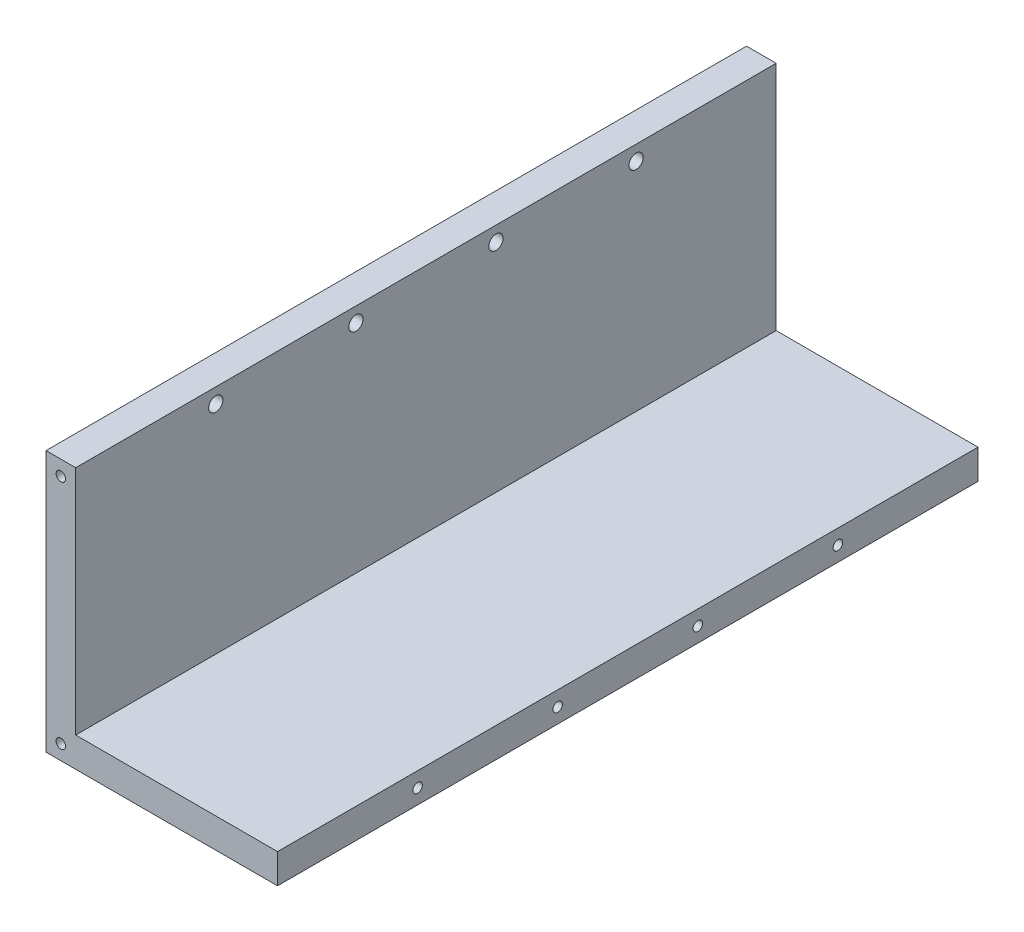
ISO-10303-21;
HEADER;
FILE_DESCRIPTION(('STEP AP214'),'2;1');
FILE_NAME('part.step','',(''),(''),'','','');
FILE_SCHEMA(('AUTOMOTIVE_DESIGN { 1 0 10303 214 1 1 1 1 }'));
ENDSEC;
DATA;
#1=APPLICATION_CONTEXT('core data for automotive mechanical design processes');
#2=APPLICATION_PROTOCOL_DEFINITION('international standard','automotive_design',2000,#1);
#3=PRODUCT_CONTEXT('',#1,'mechanical');
#4=PRODUCT('Part','Part','',(#3));
#5=PRODUCT_RELATED_PRODUCT_CATEGORY('part','',(#4));
#6=PRODUCT_DEFINITION_FORMATION('','',#4);
#7=PRODUCT_DEFINITION_CONTEXT('part definition',#1,'design');
#8=PRODUCT_DEFINITION('design','',#6,#7);
#9=PRODUCT_DEFINITION_SHAPE('','',#8);
#10=(LENGTH_UNIT() NAMED_UNIT(*) SI_UNIT(.MILLI.,.METRE.));
#11=(NAMED_UNIT(*) PLANE_ANGLE_UNIT() SI_UNIT($,.RADIAN.));
#12=(NAMED_UNIT(*) SI_UNIT($,.STERADIAN.) SOLID_ANGLE_UNIT());
#13=UNCERTAINTY_MEASURE_WITH_UNIT(LENGTH_MEASURE(1.E-05),#10,'distance_accuracy_value','');
#14=(GEOMETRIC_REPRESENTATION_CONTEXT(3) GLOBAL_UNCERTAINTY_ASSIGNED_CONTEXT((#13)) GLOBAL_UNIT_ASSIGNED_CONTEXT((#10,
#11,#12)) REPRESENTATION_CONTEXT('',''));
#15=CARTESIAN_POINT('',(0.,0.,0.));
#16=DIRECTION('',(0.,0.,1.));
#17=DIRECTION('',(1.,0.,0.));
#18=AXIS2_PLACEMENT_3D('',#15,#16,#17);
#19=CARTESIAN_POINT('',(0.,0.,118.));
#20=DIRECTION('',(-1.,0.,0.));
#21=DIRECTION('',(0.,0.,1.));
#22=AXIS2_PLACEMENT_3D('',#19,#20,#21);
#23=PLANE('',#22);
#24=CARTESIAN_POINT('',(0.,36.5,70.8));
#25=DIRECTION('',(-1.,0.,0.));
#26=DIRECTION('',(0.,0.,1.));
#27=AXIS2_PLACEMENT_3D('',#24,#25,#26);
#28=CIRCLE('',#27,1.2);
#29=CARTESIAN_POINT('',(0.,36.5,72.));
#30=VERTEX_POINT('',#29);
#31=EDGE_CURVE('E222',#30,#30,#28,.F.);
#32=ORIENTED_EDGE('',*,*,#31,.F.);
#33=EDGE_LOOP('',(#32));
#34=FACE_BOUND('',#33,.T.);
#35=DIRECTION('',(0.,1.,0.));
#36=VECTOR('',#35,1.);
#37=CARTESIAN_POINT('',(0.,0.,0.));
#38=LINE('',#37,#36);
#39=CARTESIAN_POINT('',(0.,0.,0.));
#40=VERTEX_POINT('',#39);
#41=CARTESIAN_POINT('',(0.,39.,0.));
#42=VERTEX_POINT('',#41);
#43=EDGE_CURVE('E136',#40,#42,#38,.T.);
#44=ORIENTED_EDGE('',*,*,#43,.T.);
#45=DIRECTION('',(0.,0.,-1.));
#46=VECTOR('',#45,1.);
#47=CARTESIAN_POINT('',(0.,39.,118.));
#48=LINE('',#47,#46);
#49=CARTESIAN_POINT('',(0.,39.,118.));
#50=VERTEX_POINT('',#49);
#51=EDGE_CURVE('E54',#50,#42,#48,.T.);
#52=ORIENTED_EDGE('',*,*,#51,.F.);
#53=DIRECTION('',(0.,1.,0.));
#54=VECTOR('',#53,1.);
#55=CARTESIAN_POINT('',(0.,0.,118.));
#56=LINE('',#55,#54);
#57=CARTESIAN_POINT('',(0.,0.,118.));
#58=VERTEX_POINT('',#57);
#59=EDGE_CURVE('E99',#58,#50,#56,.T.);
#60=ORIENTED_EDGE('',*,*,#59,.F.);
#61=DIRECTION('',(0.,0.,-1.));
#62=VECTOR('',#61,1.);
#63=CARTESIAN_POINT('',(0.,0.,118.));
#64=LINE('',#63,#62);
#65=EDGE_CURVE('E11',#58,#40,#64,.T.);
#66=ORIENTED_EDGE('',*,*,#65,.T.);
#67=EDGE_LOOP('',(#44,#52,#60,#66));
#68=FACE_BOUND('',#67,.T.);
#69=CARTESIAN_POINT('',(0.,36.5,23.6));
#70=DIRECTION('',(-1.,0.,0.));
#71=DIRECTION('',(0.,0.,1.));
#72=AXIS2_PLACEMENT_3D('',#69,#70,#71);
#73=CIRCLE('',#72,1.2);
#74=CARTESIAN_POINT('',(0.,36.5,24.8));
#75=VERTEX_POINT('',#74);
#76=EDGE_CURVE('E137',#75,#75,#73,.F.);
#77=ORIENTED_EDGE('',*,*,#76,.F.);
#78=EDGE_LOOP('',(#77));
#79=FACE_BOUND('',#78,.T.);
#80=CARTESIAN_POINT('',(0.,36.5,47.2));
#81=DIRECTION('',(-1.,0.,0.));
#82=DIRECTION('',(0.,0.,1.));
#83=AXIS2_PLACEMENT_3D('',#80,#81,#82);
#84=CIRCLE('',#83,1.2);
#85=CARTESIAN_POINT('',(0.,36.5,48.4));
#86=VERTEX_POINT('',#85);
#87=EDGE_CURVE('E202',#86,#86,#84,.F.);
#88=ORIENTED_EDGE('',*,*,#87,.F.);
#89=EDGE_LOOP('',(#88));
#90=FACE_BOUND('',#89,.T.);
#91=CARTESIAN_POINT('',(0.,36.5,94.4));
#92=DIRECTION('',(-1.,0.,0.));
#93=DIRECTION('',(0.,0.,1.));
#94=AXIS2_PLACEMENT_3D('',#91,#92,#93);
#95=CIRCLE('',#94,1.2);
#96=CARTESIAN_POINT('',(0.,36.5,95.6));
#97=VERTEX_POINT('',#96);
#98=EDGE_CURVE('E216',#97,#97,#95,.F.);
#99=ORIENTED_EDGE('',*,*,#98,.F.);
#100=EDGE_LOOP('',(#99));
#101=FACE_BOUND('',#100,.T.);
#102=ADVANCED_FACE('F45',(#34,#68,#79,#90,#101),#23,.F.);
#103=CARTESIAN_POINT('',(0.,0.,118.));
#104=DIRECTION('',(0.,-1.,0.));
#105=DIRECTION('',(1.,0.,0.));
#106=AXIS2_PLACEMENT_3D('',#103,#104,#105);
#107=PLANE('',#106);
#108=DIRECTION('',(-1.,0.,0.));
#109=VECTOR('',#108,1.);
#110=CARTESIAN_POINT('',(0.,0.,0.));
#111=LINE('',#110,#109);
#112=CARTESIAN_POINT('',(34.,0.,0.));
#113=VERTEX_POINT('',#112);
#114=EDGE_CURVE('E133',#113,#40,#111,.T.);
#115=ORIENTED_EDGE('',*,*,#114,.T.);
#116=ORIENTED_EDGE('',*,*,#65,.F.);
#117=DIRECTION('',(-1.,0.,0.));
#118=VECTOR('',#117,1.);
#119=CARTESIAN_POINT('',(0.,0.,118.));
#120=LINE('',#119,#118);
#121=CARTESIAN_POINT('',(34.,0.,118.));
#122=VERTEX_POINT('',#121);
#123=EDGE_CURVE('E144',#122,#58,#120,.T.);
#124=ORIENTED_EDGE('',*,*,#123,.F.);
#125=DIRECTION('',(0.,0.,-1.));
#126=VECTOR('',#125,1.);
#127=CARTESIAN_POINT('',(34.,0.,118.));
#128=LINE('',#127,#126);
#129=EDGE_CURVE('E129',#122,#113,#128,.T.);
#130=ORIENTED_EDGE('',*,*,#129,.T.);
#131=EDGE_LOOP('',(#115,#116,#124,#130));
#132=FACE_BOUND('',#131,.T.);
#133=ADVANCED_FACE('F47',(#132),#107,.F.);
#134=CARTESIAN_POINT('',(0.,39.,118.));
#135=DIRECTION('',(0.,-1.,0.));
#136=DIRECTION('',(0.,0.,-1.));
#137=AXIS2_PLACEMENT_3D('',#134,#135,#136);
#138=PLANE('',#137);
#139=DIRECTION('',(-1.,0.,0.));
#140=VECTOR('',#139,1.);
#141=CARTESIAN_POINT('',(0.,39.,0.));
#142=LINE('',#141,#140);
#143=CARTESIAN_POINT('',(-5.,39.,0.));
#144=VERTEX_POINT('',#143);
#145=EDGE_CURVE('E139',#42,#144,#142,.T.);
#146=ORIENTED_EDGE('',*,*,#145,.T.);
#147=DIRECTION('',(0.,0.,-1.));
#148=VECTOR('',#147,1.);
#149=CARTESIAN_POINT('',(-5.,39.,118.));
#150=LINE('',#149,#148);
#151=CARTESIAN_POINT('',(-5.,39.,118.));
#152=VERTEX_POINT('',#151);
#153=EDGE_CURVE('E124',#152,#144,#150,.T.);
#154=ORIENTED_EDGE('',*,*,#153,.F.);
#155=DIRECTION('',(-1.,0.,0.));
#156=VECTOR('',#155,1.);
#157=CARTESIAN_POINT('',(0.,39.,118.));
#158=LINE('',#157,#156);
#159=EDGE_CURVE('E114',#50,#152,#158,.T.);
#160=ORIENTED_EDGE('',*,*,#159,.F.);
#161=ORIENTED_EDGE('',*,*,#51,.T.);
#162=EDGE_LOOP('',(#146,#154,#160,#161));
#163=FACE_BOUND('',#162,.T.);
#164=ADVANCED_FACE('F150',(#163),#138,.F.);
#165=CARTESIAN_POINT('',(-5.,-5.,118.));
#166=DIRECTION('',(1.,0.,0.));
#167=DIRECTION('',(0.,1.,0.));
#168=AXIS2_PLACEMENT_3D('',#165,#166,#167);
#169=PLANE('',#168);
#170=CARTESIAN_POINT('',(-5.,36.5,70.8));
#171=DIRECTION('',(-1.,0.,0.));
#172=DIRECTION('',(0.,0.,1.));
#173=AXIS2_PLACEMENT_3D('',#170,#171,#172);
#174=CIRCLE('',#173,2.2);
#175=CARTESIAN_POINT('',(-5.,36.5,73.));
#176=VERTEX_POINT('',#175);
#177=EDGE_CURVE('E188',#176,#176,#174,.T.);
#178=ORIENTED_EDGE('',*,*,#177,.F.);
#179=EDGE_LOOP('',(#178));
#180=FACE_BOUND('',#179,.T.);
#181=CARTESIAN_POINT('',(-5.,36.5,94.4));
#182=DIRECTION('',(-1.,0.,0.));
#183=DIRECTION('',(0.,0.,1.));
#184=AXIS2_PLACEMENT_3D('',#181,#182,#183);
#185=CIRCLE('',#184,2.2);
#186=CARTESIAN_POINT('',(-5.,36.5,96.6));
#187=VERTEX_POINT('',#186);
#188=EDGE_CURVE('E192',#187,#187,#185,.T.);
#189=ORIENTED_EDGE('',*,*,#188,.F.);
#190=EDGE_LOOP('',(#189));
#191=FACE_BOUND('',#190,.T.);
#192=CARTESIAN_POINT('',(-5.,36.5,47.2));
#193=DIRECTION('',(-1.,0.,0.));
#194=DIRECTION('',(0.,0.,1.));
#195=AXIS2_PLACEMENT_3D('',#192,#193,#194);
#196=CIRCLE('',#195,2.2);
#197=CARTESIAN_POINT('',(-5.,36.5,49.4));
#198=VERTEX_POINT('',#197);
#199=EDGE_CURVE('E196',#198,#198,#196,.T.);
#200=ORIENTED_EDGE('',*,*,#199,.F.);
#201=EDGE_LOOP('',(#200));
#202=FACE_BOUND('',#201,.T.);
#203=CARTESIAN_POINT('',(-5.,36.5,23.6));
#204=DIRECTION('',(-1.,0.,0.));
#205=DIRECTION('',(0.,0.,1.));
#206=AXIS2_PLACEMENT_3D('',#203,#204,#205);
#207=CIRCLE('',#206,2.2);
#208=CARTESIAN_POINT('',(-5.,36.5,25.8));
#209=VERTEX_POINT('',#208);
#210=EDGE_CURVE('E199',#209,#209,#207,.T.);
#211=ORIENTED_EDGE('',*,*,#210,.F.);
#212=EDGE_LOOP('',(#211));
#213=FACE_BOUND('',#212,.T.);
#214=DIRECTION('',(0.,-1.,0.));
#215=VECTOR('',#214,1.);
#216=CARTESIAN_POINT('',(-5.,-5.,0.));
#217=LINE('',#216,#215);
#218=CARTESIAN_POINT('',(-5.,-5.,0.));
#219=VERTEX_POINT('',#218);
#220=EDGE_CURVE('E123',#144,#219,#217,.T.);
#221=ORIENTED_EDGE('',*,*,#220,.T.);
#222=DIRECTION('',(0.,0.,-1.));
#223=VECTOR('',#222,1.);
#224=CARTESIAN_POINT('',(-5.,-5.,118.));
#225=LINE('',#224,#223);
#226=CARTESIAN_POINT('',(-5.,-5.,118.));
#227=VERTEX_POINT('',#226);
#228=EDGE_CURVE('E120',#227,#219,#225,.T.);
#229=ORIENTED_EDGE('',*,*,#228,.F.);
#230=DIRECTION('',(0.,-1.,0.));
#231=VECTOR('',#230,1.);
#232=CARTESIAN_POINT('',(-5.,-5.,118.));
#233=LINE('',#232,#231);
#234=EDGE_CURVE('E108',#152,#227,#233,.T.);
#235=ORIENTED_EDGE('',*,*,#234,.F.);
#236=ORIENTED_EDGE('',*,*,#153,.T.);
#237=EDGE_LOOP('',(#221,#229,#235,#236));
#238=FACE_BOUND('',#237,.T.);
#239=ADVANCED_FACE('F121',(#180,#191,#202,#213,#238),#169,.F.);
#240=CARTESIAN_POINT('',(0.,-5.,118.));
#241=DIRECTION('',(0.,1.,0.));
#242=DIRECTION('',(-1.,0.,0.));
#243=AXIS2_PLACEMENT_3D('',#240,#241,#242);
#244=PLANE('',#243);
#245=DIRECTION('',(1.,0.,0.));
#246=VECTOR('',#245,1.);
#247=CARTESIAN_POINT('',(0.,-5.,0.));
#248=LINE('',#247,#246);
#249=CARTESIAN_POINT('',(34.,-5.,0.));
#250=VERTEX_POINT('',#249);
#251=EDGE_CURVE('E85',#219,#250,#248,.T.);
#252=ORIENTED_EDGE('',*,*,#251,.T.);
#253=DIRECTION('',(0.,0.,-1.));
#254=VECTOR('',#253,1.);
#255=CARTESIAN_POINT('',(34.,-5.,118.));
#256=LINE('',#255,#254);
#257=CARTESIAN_POINT('',(34.,-5.,118.));
#258=VERTEX_POINT('',#257);
#259=EDGE_CURVE('E125',#258,#250,#256,.T.);
#260=ORIENTED_EDGE('',*,*,#259,.F.);
#261=DIRECTION('',(1.,0.,0.));
#262=VECTOR('',#261,1.);
#263=CARTESIAN_POINT('',(0.,-5.,118.));
#264=LINE('',#263,#262);
#265=EDGE_CURVE('E112',#227,#258,#264,.T.);
#266=ORIENTED_EDGE('',*,*,#265,.F.);
#267=ORIENTED_EDGE('',*,*,#228,.T.);
#268=EDGE_LOOP('',(#252,#260,#266,#267));
#269=FACE_BOUND('',#268,.T.);
#270=ADVANCED_FACE('F127',(#269),#244,.F.);
#271=CARTESIAN_POINT('',(34.,0.,118.));
#272=DIRECTION('',(-1.,0.,0.));
#273=DIRECTION('',(0.,0.,1.));
#274=AXIS2_PLACEMENT_3D('',#271,#272,#273);
#275=PLANE('',#274);
#276=CARTESIAN_POINT('',(34.,-2.5,70.8));
#277=DIRECTION('',(1.,0.,0.));
#278=DIRECTION('',(0.,0.,-1.));
#279=AXIS2_PLACEMENT_3D('',#276,#277,#278);
#280=CIRCLE('',#279,0.799999999999999);
#281=CARTESIAN_POINT('',(34.,-2.5,70.));
#282=VERTEX_POINT('',#281);
#283=EDGE_CURVE('E252',#282,#282,#280,.T.);
#284=ORIENTED_EDGE('',*,*,#283,.F.);
#285=EDGE_LOOP('',(#284));
#286=FACE_BOUND('',#285,.T.);
#287=CARTESIAN_POINT('',(34.,-2.5,94.4));
#288=DIRECTION('',(1.,0.,0.));
#289=DIRECTION('',(0.,0.,-1.));
#290=AXIS2_PLACEMENT_3D('',#287,#288,#289);
#291=CIRCLE('',#290,0.799999999999999);
#292=CARTESIAN_POINT('',(34.,-2.5,93.6));
#293=VERTEX_POINT('',#292);
#294=EDGE_CURVE('E246',#293,#293,#291,.T.);
#295=ORIENTED_EDGE('',*,*,#294,.F.);
#296=EDGE_LOOP('',(#295));
#297=FACE_BOUND('',#296,.T.);
#298=CARTESIAN_POINT('',(34.,-2.5,47.2));
#299=DIRECTION('',(1.,0.,0.));
#300=DIRECTION('',(0.,0.,-1.));
#301=AXIS2_PLACEMENT_3D('',#298,#299,#300);
#302=CIRCLE('',#301,0.799999999999999);
#303=CARTESIAN_POINT('',(34.,-2.5,46.4));
#304=VERTEX_POINT('',#303);
#305=EDGE_CURVE('E240',#304,#304,#302,.T.);
#306=ORIENTED_EDGE('',*,*,#305,.F.);
#307=EDGE_LOOP('',(#306));
#308=FACE_BOUND('',#307,.T.);
#309=CARTESIAN_POINT('',(34.,-2.5,23.6));
#310=DIRECTION('',(1.,0.,0.));
#311=DIRECTION('',(0.,0.,-1.));
#312=AXIS2_PLACEMENT_3D('',#309,#310,#311);
#313=CIRCLE('',#312,0.799999999999999);
#314=CARTESIAN_POINT('',(34.,-2.5,22.8));
#315=VERTEX_POINT('',#314);
#316=EDGE_CURVE('E234',#315,#315,#313,.T.);
#317=ORIENTED_EDGE('',*,*,#316,.F.);
#318=EDGE_LOOP('',(#317));
#319=FACE_BOUND('',#318,.T.);
#320=DIRECTION('',(0.,1.,0.));
#321=VECTOR('',#320,1.);
#322=CARTESIAN_POINT('',(34.,0.,0.));
#323=LINE('',#322,#321);
#324=EDGE_CURVE('E91',#250,#113,#323,.T.);
#325=ORIENTED_EDGE('',*,*,#324,.T.);
#326=ORIENTED_EDGE('',*,*,#129,.F.);
#327=DIRECTION('',(0.,1.,0.));
#328=VECTOR('',#327,1.);
#329=CARTESIAN_POINT('',(34.,0.,118.));
#330=LINE('',#329,#328);
#331=EDGE_CURVE('E62',#258,#122,#330,.T.);
#332=ORIENTED_EDGE('',*,*,#331,.F.);
#333=ORIENTED_EDGE('',*,*,#259,.T.);
#334=EDGE_LOOP('',(#325,#326,#332,#333));
#335=FACE_BOUND('',#334,.T.);
#336=ADVANCED_FACE('F157',(#286,#297,#308,#319,#335),#275,.F.);
#337=CARTESIAN_POINT('',(0.,0.,118.));
#338=DIRECTION('',(0.,0.,-1.));
#339=DIRECTION('',(-1.,0.,0.));
#340=AXIS2_PLACEMENT_3D('',#337,#338,#339);
#341=PLANE('',#340);
#342=CARTESIAN_POINT('',(-2.5,36.5,118.));
#343=DIRECTION('',(0.,0.,1.));
#344=DIRECTION('',(1.,0.,0.));
#345=AXIS2_PLACEMENT_3D('',#342,#343,#344);
#346=CIRCLE('',#345,0.799999999999988);
#347=CARTESIAN_POINT('',(-1.70000000000001,36.5,118.));
#348=VERTEX_POINT('',#347);
#349=EDGE_CURVE('E264',#348,#348,#346,.T.);
#350=ORIENTED_EDGE('',*,*,#349,.F.);
#351=EDGE_LOOP('',(#350));
#352=FACE_BOUND('',#351,.T.);
#353=CARTESIAN_POINT('',(-2.5,-2.5,118.));
#354=DIRECTION('',(0.,0.,1.));
#355=DIRECTION('',(1.,0.,0.));
#356=AXIS2_PLACEMENT_3D('',#353,#354,#355);
#357=CIRCLE('',#356,0.799999999999988);
#358=CARTESIAN_POINT('',(-1.70000000000001,-2.5,118.));
#359=VERTEX_POINT('',#358);
#360=EDGE_CURVE('E258',#359,#359,#357,.T.);
#361=ORIENTED_EDGE('',*,*,#360,.F.);
#362=EDGE_LOOP('',(#361));
#363=FACE_BOUND('',#362,.T.);
#364=ORIENTED_EDGE('',*,*,#123,.T.);
#365=ORIENTED_EDGE('',*,*,#59,.T.);
#366=ORIENTED_EDGE('',*,*,#159,.T.);
#367=ORIENTED_EDGE('',*,*,#234,.T.);
#368=ORIENTED_EDGE('',*,*,#265,.T.);
#369=ORIENTED_EDGE('',*,*,#331,.T.);
#370=EDGE_LOOP('',(#364,#365,#366,#367,#368,#369));
#371=FACE_BOUND('',#370,.T.);
#372=ADVANCED_FACE('F110',(#352,#363,#371),#341,.F.);
#373=CARTESIAN_POINT('',(0.,0.,0.));
#374=DIRECTION('',(0.,0.,-1.));
#375=DIRECTION('',(-1.,0.,0.));
#376=AXIS2_PLACEMENT_3D('',#373,#374,#375);
#377=PLANE('',#376);
#378=CARTESIAN_POINT('',(-2.5,36.5,0.));
#379=DIRECTION('',(0.,0.,-1.));
#380=DIRECTION('',(-1.,0.,0.));
#381=AXIS2_PLACEMENT_3D('',#378,#379,#380);
#382=CIRCLE('',#381,0.799999999999988);
#383=CARTESIAN_POINT('',(-3.29999999999998,36.5,0.));
#384=VERTEX_POINT('',#383);
#385=EDGE_CURVE('E276',#384,#384,#382,.T.);
#386=ORIENTED_EDGE('',*,*,#385,.F.);
#387=EDGE_LOOP('',(#386));
#388=FACE_BOUND('',#387,.T.);
#389=CARTESIAN_POINT('',(-2.5,-2.5,0.));
#390=DIRECTION('',(0.,0.,-1.));
#391=DIRECTION('',(-1.,0.,0.));
#392=AXIS2_PLACEMENT_3D('',#389,#390,#391);
#393=CIRCLE('',#392,0.799999999999988);
#394=CARTESIAN_POINT('',(-3.29999999999998,-2.5,0.));
#395=VERTEX_POINT('',#394);
#396=EDGE_CURVE('E270',#395,#395,#393,.T.);
#397=ORIENTED_EDGE('',*,*,#396,.F.);
#398=EDGE_LOOP('',(#397));
#399=FACE_BOUND('',#398,.T.);
#400=ORIENTED_EDGE('',*,*,#114,.F.);
#401=ORIENTED_EDGE('',*,*,#324,.F.);
#402=ORIENTED_EDGE('',*,*,#251,.F.);
#403=ORIENTED_EDGE('',*,*,#220,.F.);
#404=ORIENTED_EDGE('',*,*,#145,.F.);
#405=ORIENTED_EDGE('',*,*,#43,.F.);
#406=EDGE_LOOP('',(#400,#401,#402,#403,#404,#405));
#407=FACE_BOUND('',#406,.T.);
#408=ADVANCED_FACE('F153',(#388,#399,#407),#377,.T.);
#409=CARTESIAN_POINT('',(-5.,36.5,23.6));
#410=DIRECTION('',(-1.,0.,0.));
#411=DIRECTION('',(0.,0.,1.));
#412=AXIS2_PLACEMENT_3D('',#409,#410,#411);
#413=CYLINDRICAL_SURFACE('',#412,1.2);
#414=ORIENTED_EDGE('',*,*,#76,.T.);
#415=EDGE_LOOP('',(#414));
#416=FACE_BOUND('',#415,.T.);
#417=CARTESIAN_POINT('',(-4.,36.5,23.6));
#418=DIRECTION('',(-1.,0.,0.));
#419=DIRECTION('',(0.,0.,1.));
#420=AXIS2_PLACEMENT_3D('',#417,#418,#419);
#421=CIRCLE('',#420,1.2);
#422=CARTESIAN_POINT('',(-4.,36.5,24.8));
#423=VERTEX_POINT('',#422);
#424=EDGE_CURVE('E201',#423,#423,#421,.T.);
#425=ORIENTED_EDGE('',*,*,#424,.T.);
#426=EDGE_LOOP('',(#425));
#427=FACE_BOUND('',#426,.T.);
#428=ADVANCED_FACE('F284',(#416,#427),#413,.F.);
#429=CARTESIAN_POINT('',(-5.,36.5,23.6));
#430=DIRECTION('',(-1.,0.,0.));
#431=DIRECTION('',(0.,0.,1.));
#432=AXIS2_PLACEMENT_3D('',#429,#430,#431);
#433=CONICAL_SURFACE('',#432,2.2,0.785398163397448);
#434=ORIENTED_EDGE('',*,*,#424,.F.);
#435=EDGE_LOOP('',(#434));
#436=FACE_BOUND('',#435,.T.);
#437=ORIENTED_EDGE('',*,*,#210,.T.);
#438=EDGE_LOOP('',(#437));
#439=FACE_BOUND('',#438,.T.);
#440=ADVANCED_FACE('F375',(#436,#439),#433,.F.);
#441=CARTESIAN_POINT('',(-5.,36.5,47.2));
#442=DIRECTION('',(-1.,0.,0.));
#443=DIRECTION('',(0.,0.,1.));
#444=AXIS2_PLACEMENT_3D('',#441,#442,#443);
#445=CYLINDRICAL_SURFACE('',#444,1.2);
#446=ORIENTED_EDGE('',*,*,#87,.T.);
#447=EDGE_LOOP('',(#446));
#448=FACE_BOUND('',#447,.T.);
#449=CARTESIAN_POINT('',(-4.,36.5,47.2));
#450=DIRECTION('',(-1.,0.,0.));
#451=DIRECTION('',(0.,0.,1.));
#452=AXIS2_PLACEMENT_3D('',#449,#450,#451);
#453=CIRCLE('',#452,1.2);
#454=CARTESIAN_POINT('',(-4.,36.5,48.4));
#455=VERTEX_POINT('',#454);
#456=EDGE_CURVE('E207',#455,#455,#453,.T.);
#457=ORIENTED_EDGE('',*,*,#456,.T.);
#458=EDGE_LOOP('',(#457));
#459=FACE_BOUND('',#458,.T.);
#460=ADVANCED_FACE('F371',(#448,#459),#445,.F.);
#461=CARTESIAN_POINT('',(-5.,36.5,47.2));
#462=DIRECTION('',(-1.,0.,0.));
#463=DIRECTION('',(0.,0.,1.));
#464=AXIS2_PLACEMENT_3D('',#461,#462,#463);
#465=CONICAL_SURFACE('',#464,2.2,0.785398163397448);
#466=ORIENTED_EDGE('',*,*,#456,.F.);
#467=EDGE_LOOP('',(#466));
#468=FACE_BOUND('',#467,.T.);
#469=ORIENTED_EDGE('',*,*,#199,.T.);
#470=EDGE_LOOP('',(#469));
#471=FACE_BOUND('',#470,.T.);
#472=ADVANCED_FACE('F367',(#468,#471),#465,.F.);
#473=CARTESIAN_POINT('',(-5.,36.5,94.4));
#474=DIRECTION('',(-1.,0.,0.));
#475=DIRECTION('',(0.,0.,1.));
#476=AXIS2_PLACEMENT_3D('',#473,#474,#475);
#477=CYLINDRICAL_SURFACE('',#476,1.2);
#478=ORIENTED_EDGE('',*,*,#98,.T.);
#479=EDGE_LOOP('',(#478));
#480=FACE_BOUND('',#479,.T.);
#481=CARTESIAN_POINT('',(-4.,36.5,94.4));
#482=DIRECTION('',(-1.,0.,0.));
#483=DIRECTION('',(0.,0.,1.));
#484=AXIS2_PLACEMENT_3D('',#481,#482,#483);
#485=CIRCLE('',#484,1.2);
#486=CARTESIAN_POINT('',(-4.,36.5,95.6));
#487=VERTEX_POINT('',#486);
#488=EDGE_CURVE('E218',#487,#487,#485,.T.);
#489=ORIENTED_EDGE('',*,*,#488,.T.);
#490=EDGE_LOOP('',(#489));
#491=FACE_BOUND('',#490,.T.);
#492=ADVANCED_FACE('F363',(#480,#491),#477,.F.);
#493=CARTESIAN_POINT('',(-5.,36.5,94.4));
#494=DIRECTION('',(-1.,0.,0.));
#495=DIRECTION('',(0.,0.,1.));
#496=AXIS2_PLACEMENT_3D('',#493,#494,#495);
#497=CONICAL_SURFACE('',#496,2.2,0.785398163397448);
#498=ORIENTED_EDGE('',*,*,#488,.F.);
#499=EDGE_LOOP('',(#498));
#500=FACE_BOUND('',#499,.T.);
#501=ORIENTED_EDGE('',*,*,#188,.T.);
#502=EDGE_LOOP('',(#501));
#503=FACE_BOUND('',#502,.T.);
#504=ADVANCED_FACE('F359',(#500,#503),#497,.F.);
#505=CARTESIAN_POINT('',(-5.,36.5,70.8));
#506=DIRECTION('',(-1.,0.,0.));
#507=DIRECTION('',(0.,0.,1.));
#508=AXIS2_PLACEMENT_3D('',#505,#506,#507);
#509=CYLINDRICAL_SURFACE('',#508,1.2);
#510=ORIENTED_EDGE('',*,*,#31,.T.);
#511=EDGE_LOOP('',(#510));
#512=FACE_BOUND('',#511,.T.);
#513=CARTESIAN_POINT('',(-4.,36.5,70.8));
#514=DIRECTION('',(-1.,0.,0.));
#515=DIRECTION('',(0.,0.,1.));
#516=AXIS2_PLACEMENT_3D('',#513,#514,#515);
#517=CIRCLE('',#516,1.2);
#518=CARTESIAN_POINT('',(-4.,36.5,72.));
#519=VERTEX_POINT('',#518);
#520=EDGE_CURVE('E225',#519,#519,#517,.T.);
#521=ORIENTED_EDGE('',*,*,#520,.T.);
#522=EDGE_LOOP('',(#521));
#523=FACE_BOUND('',#522,.T.);
#524=ADVANCED_FACE('F355',(#512,#523),#509,.F.);
#525=CARTESIAN_POINT('',(-5.,36.5,70.8));
#526=DIRECTION('',(-1.,0.,0.));
#527=DIRECTION('',(0.,0.,1.));
#528=AXIS2_PLACEMENT_3D('',#525,#526,#527);
#529=CONICAL_SURFACE('',#528,2.2,0.785398163397448);
#530=ORIENTED_EDGE('',*,*,#520,.F.);
#531=EDGE_LOOP('',(#530));
#532=FACE_BOUND('',#531,.T.);
#533=ORIENTED_EDGE('',*,*,#177,.T.);
#534=EDGE_LOOP('',(#533));
#535=FACE_BOUND('',#534,.T.);
#536=ADVANCED_FACE('F351',(#532,#535),#529,.F.);
#537=CARTESIAN_POINT('',(26.,-2.5,23.6));
#538=DIRECTION('',(1.,0.,0.));
#539=DIRECTION('',(0.,0.,-1.));
#540=AXIS2_PLACEMENT_3D('',#537,#538,#539);
#541=CONICAL_SURFACE('',#540,0.799999999999998,1.02974425867665);
#542=CARTESIAN_POINT('',(25.519311504778,-2.5,23.6));
#543=VERTEX_POINT('',#542);
#544=VERTEX_LOOP('',#543);
#545=FACE_BOUND('',#544,.T.);
#546=CARTESIAN_POINT('',(26.,-2.5,23.6));
#547=DIRECTION('',(1.,0.,0.));
#548=DIRECTION('',(0.,0.,-1.));
#549=AXIS2_PLACEMENT_3D('',#546,#547,#548);
#550=CIRCLE('',#549,0.799999999999998);
#551=CARTESIAN_POINT('',(26.,-2.5,22.8));
#552=VERTEX_POINT('',#551);
#553=EDGE_CURVE('E229',#552,#552,#550,.T.);
#554=ORIENTED_EDGE('',*,*,#553,.T.);
#555=EDGE_LOOP('',(#554));
#556=FACE_BOUND('',#555,.T.);
#557=ADVANCED_FACE('F347',(#545,#556),#541,.F.);
#558=CARTESIAN_POINT('',(34.,-2.5,23.6));
#559=DIRECTION('',(1.,0.,0.));
#560=DIRECTION('',(0.,0.,-1.));
#561=AXIS2_PLACEMENT_3D('',#558,#559,#560);
#562=CYLINDRICAL_SURFACE('',#561,0.799999999999998);
#563=ORIENTED_EDGE('',*,*,#553,.F.);
#564=EDGE_LOOP('',(#563));
#565=FACE_BOUND('',#564,.T.);
#566=ORIENTED_EDGE('',*,*,#316,.T.);
#567=EDGE_LOOP('',(#566));
#568=FACE_BOUND('',#567,.T.);
#569=ADVANCED_FACE('F344',(#565,#568),#562,.F.);
#570=CARTESIAN_POINT('',(26.,-2.5,47.2));
#571=DIRECTION('',(1.,0.,0.));
#572=DIRECTION('',(0.,0.,-1.));
#573=AXIS2_PLACEMENT_3D('',#570,#571,#572);
#574=CONICAL_SURFACE('',#573,0.799999999999998,1.02974425867665);
#575=CARTESIAN_POINT('',(25.519311504778,-2.5,47.2));
#576=VERTEX_POINT('',#575);
#577=VERTEX_LOOP('',#576);
#578=FACE_BOUND('',#577,.T.);
#579=CARTESIAN_POINT('',(26.,-2.5,47.2));
#580=DIRECTION('',(1.,0.,0.));
#581=DIRECTION('',(0.,0.,-1.));
#582=AXIS2_PLACEMENT_3D('',#579,#580,#581);
#583=CIRCLE('',#582,0.799999999999998);
#584=CARTESIAN_POINT('',(26.,-2.5,46.4));
#585=VERTEX_POINT('',#584);
#586=EDGE_CURVE('E237',#585,#585,#583,.T.);
#587=ORIENTED_EDGE('',*,*,#586,.T.);
#588=EDGE_LOOP('',(#587));
#589=FACE_BOUND('',#588,.T.);
#590=ADVANCED_FACE('F340',(#578,#589),#574,.F.);
#591=CARTESIAN_POINT('',(34.,-2.5,47.2));
#592=DIRECTION('',(1.,0.,0.));
#593=DIRECTION('',(0.,0.,-1.));
#594=AXIS2_PLACEMENT_3D('',#591,#592,#593);
#595=CYLINDRICAL_SURFACE('',#594,0.799999999999998);
#596=ORIENTED_EDGE('',*,*,#586,.F.);
#597=EDGE_LOOP('',(#596));
#598=FACE_BOUND('',#597,.T.);
#599=ORIENTED_EDGE('',*,*,#305,.T.);
#600=EDGE_LOOP('',(#599));
#601=FACE_BOUND('',#600,.T.);
#602=ADVANCED_FACE('F336',(#598,#601),#595,.F.);
#603=CARTESIAN_POINT('',(26.,-2.5,94.4));
#604=DIRECTION('',(1.,0.,0.));
#605=DIRECTION('',(0.,0.,-1.));
#606=AXIS2_PLACEMENT_3D('',#603,#604,#605);
#607=CONICAL_SURFACE('',#606,0.799999999999998,1.02974425867665);
#608=CARTESIAN_POINT('',(25.519311504778,-2.5,94.4));
#609=VERTEX_POINT('',#608);
#610=VERTEX_LOOP('',#609);
#611=FACE_BOUND('',#610,.T.);
#612=CARTESIAN_POINT('',(26.,-2.5,94.4));
#613=DIRECTION('',(1.,0.,0.));
#614=DIRECTION('',(0.,0.,-1.));
#615=AXIS2_PLACEMENT_3D('',#612,#613,#614);
#616=CIRCLE('',#615,0.799999999999998);
#617=CARTESIAN_POINT('',(26.,-2.5,93.6));
#618=VERTEX_POINT('',#617);
#619=EDGE_CURVE('E243',#618,#618,#616,.T.);
#620=ORIENTED_EDGE('',*,*,#619,.T.);
#621=EDGE_LOOP('',(#620));
#622=FACE_BOUND('',#621,.T.);
#623=ADVANCED_FACE('F332',(#611,#622),#607,.F.);
#624=CARTESIAN_POINT('',(34.,-2.5,94.4));
#625=DIRECTION('',(1.,0.,0.));
#626=DIRECTION('',(0.,0.,-1.));
#627=AXIS2_PLACEMENT_3D('',#624,#625,#626);
#628=CYLINDRICAL_SURFACE('',#627,0.799999999999998);
#629=ORIENTED_EDGE('',*,*,#619,.F.);
#630=EDGE_LOOP('',(#629));
#631=FACE_BOUND('',#630,.T.);
#632=ORIENTED_EDGE('',*,*,#294,.T.);
#633=EDGE_LOOP('',(#632));
#634=FACE_BOUND('',#633,.T.);
#635=ADVANCED_FACE('F328',(#631,#634),#628,.F.);
#636=CARTESIAN_POINT('',(26.,-2.5,70.8));
#637=DIRECTION('',(1.,0.,0.));
#638=DIRECTION('',(0.,0.,-1.));
#639=AXIS2_PLACEMENT_3D('',#636,#637,#638);
#640=CONICAL_SURFACE('',#639,0.799999999999998,1.02974425867665);
#641=CARTESIAN_POINT('',(25.519311504778,-2.5,70.8));
#642=VERTEX_POINT('',#641);
#643=VERTEX_LOOP('',#642);
#644=FACE_BOUND('',#643,.T.);
#645=CARTESIAN_POINT('',(26.,-2.5,70.8));
#646=DIRECTION('',(1.,0.,0.));
#647=DIRECTION('',(0.,0.,-1.));
#648=AXIS2_PLACEMENT_3D('',#645,#646,#647);
#649=CIRCLE('',#648,0.799999999999998);
#650=CARTESIAN_POINT('',(26.,-2.5,70.));
#651=VERTEX_POINT('',#650);
#652=EDGE_CURVE('E249',#651,#651,#649,.T.);
#653=ORIENTED_EDGE('',*,*,#652,.T.);
#654=EDGE_LOOP('',(#653));
#655=FACE_BOUND('',#654,.T.);
#656=ADVANCED_FACE('F324',(#644,#655),#640,.F.);
#657=CARTESIAN_POINT('',(34.,-2.5,70.8));
#658=DIRECTION('',(1.,0.,0.));
#659=DIRECTION('',(0.,0.,-1.));
#660=AXIS2_PLACEMENT_3D('',#657,#658,#659);
#661=CYLINDRICAL_SURFACE('',#660,0.799999999999998);
#662=ORIENTED_EDGE('',*,*,#652,.F.);
#663=EDGE_LOOP('',(#662));
#664=FACE_BOUND('',#663,.T.);
#665=ORIENTED_EDGE('',*,*,#283,.T.);
#666=EDGE_LOOP('',(#665));
#667=FACE_BOUND('',#666,.T.);
#668=ADVANCED_FACE('F320',(#664,#667),#661,.F.);
#669=CARTESIAN_POINT('',(-2.5,-2.5,110.));
#670=DIRECTION('',(0.,0.,1.));
#671=DIRECTION('',(1.,0.,0.));
#672=AXIS2_PLACEMENT_3D('',#669,#670,#671);
#673=CONICAL_SURFACE('',#672,0.799999999999998,1.02974425867666);
#674=CARTESIAN_POINT('',(-2.5,-2.5,109.519311504778));
#675=VERTEX_POINT('',#674);
#676=VERTEX_LOOP('',#675);
#677=FACE_BOUND('',#676,.T.);
#678=CARTESIAN_POINT('',(-2.5,-2.5,110.));
#679=DIRECTION('',(0.,0.,1.));
#680=DIRECTION('',(1.,0.,0.));
#681=AXIS2_PLACEMENT_3D('',#678,#679,#680);
#682=CIRCLE('',#681,0.799999999999998);
#683=CARTESIAN_POINT('',(-1.7,-2.5,110.));
#684=VERTEX_POINT('',#683);
#685=EDGE_CURVE('E255',#684,#684,#682,.T.);
#686=ORIENTED_EDGE('',*,*,#685,.T.);
#687=EDGE_LOOP('',(#686));
#688=FACE_BOUND('',#687,.T.);
#689=ADVANCED_FACE('F316',(#677,#688),#673,.F.);
#690=CARTESIAN_POINT('',(-2.5,-2.5,118.));
#691=DIRECTION('',(0.,0.,1.));
#692=DIRECTION('',(1.,0.,0.));
#693=AXIS2_PLACEMENT_3D('',#690,#691,#692);
#694=CYLINDRICAL_SURFACE('',#693,0.799999999999993);
#695=ORIENTED_EDGE('',*,*,#685,.F.);
#696=EDGE_LOOP('',(#695));
#697=FACE_BOUND('',#696,.T.);
#698=ORIENTED_EDGE('',*,*,#360,.T.);
#699=EDGE_LOOP('',(#698));
#700=FACE_BOUND('',#699,.T.);
#701=ADVANCED_FACE('F312',(#697,#700),#694,.F.);
#702=CARTESIAN_POINT('',(-2.5,36.5,110.));
#703=DIRECTION('',(0.,0.,1.));
#704=DIRECTION('',(1.,0.,0.));
#705=AXIS2_PLACEMENT_3D('',#702,#703,#704);
#706=CONICAL_SURFACE('',#705,0.799999999999998,1.02974425867666);
#707=CARTESIAN_POINT('',(-2.5,36.5,109.519311504778));
#708=VERTEX_POINT('',#707);
#709=VERTEX_LOOP('',#708);
#710=FACE_BOUND('',#709,.T.);
#711=CARTESIAN_POINT('',(-2.5,36.5,110.));
#712=DIRECTION('',(0.,0.,1.));
#713=DIRECTION('',(1.,0.,0.));
#714=AXIS2_PLACEMENT_3D('',#711,#712,#713);
#715=CIRCLE('',#714,0.799999999999998);
#716=CARTESIAN_POINT('',(-1.7,36.5,110.));
#717=VERTEX_POINT('',#716);
#718=EDGE_CURVE('E261',#717,#717,#715,.T.);
#719=ORIENTED_EDGE('',*,*,#718,.T.);
#720=EDGE_LOOP('',(#719));
#721=FACE_BOUND('',#720,.T.);
#722=ADVANCED_FACE('F308',(#710,#721),#706,.F.);
#723=CARTESIAN_POINT('',(-2.5,36.5,118.));
#724=DIRECTION('',(0.,0.,1.));
#725=DIRECTION('',(1.,0.,0.));
#726=AXIS2_PLACEMENT_3D('',#723,#724,#725);
#727=CYLINDRICAL_SURFACE('',#726,0.799999999999993);
#728=ORIENTED_EDGE('',*,*,#718,.F.);
#729=EDGE_LOOP('',(#728));
#730=FACE_BOUND('',#729,.T.);
#731=ORIENTED_EDGE('',*,*,#349,.T.);
#732=EDGE_LOOP('',(#731));
#733=FACE_BOUND('',#732,.T.);
#734=ADVANCED_FACE('F300',(#730,#733),#727,.F.);
#735=CARTESIAN_POINT('',(-2.5,-2.5,8.));
#736=DIRECTION('',(0.,0.,-1.));
#737=DIRECTION('',(-1.,0.,0.));
#738=AXIS2_PLACEMENT_3D('',#735,#736,#737);
#739=CONICAL_SURFACE('',#738,0.799999999999998,1.02974425867665);
#740=CARTESIAN_POINT('',(-2.5,-2.5,8.48068849522205));
#741=VERTEX_POINT('',#740);
#742=VERTEX_LOOP('',#741);
#743=FACE_BOUND('',#742,.T.);
#744=CARTESIAN_POINT('',(-2.5,-2.5,8.));
#745=DIRECTION('',(0.,0.,-1.));
#746=DIRECTION('',(-1.,0.,0.));
#747=AXIS2_PLACEMENT_3D('',#744,#745,#746);
#748=CIRCLE('',#747,0.799999999999998);
#749=CARTESIAN_POINT('',(-3.29999999999999,-2.5,8.));
#750=VERTEX_POINT('',#749);
#751=EDGE_CURVE('E267',#750,#750,#748,.T.);
#752=ORIENTED_EDGE('',*,*,#751,.T.);
#753=EDGE_LOOP('',(#752));
#754=FACE_BOUND('',#753,.T.);
#755=ADVANCED_FACE('F290',(#743,#754),#739,.F.);
#756=CARTESIAN_POINT('',(-2.5,-2.5,0.));
#757=DIRECTION('',(0.,0.,-1.));
#758=DIRECTION('',(-1.,0.,0.));
#759=AXIS2_PLACEMENT_3D('',#756,#757,#758);
#760=CYLINDRICAL_SURFACE('',#759,0.799999999999993);
#761=ORIENTED_EDGE('',*,*,#751,.F.);
#762=EDGE_LOOP('',(#761));
#763=FACE_BOUND('',#762,.T.);
#764=ORIENTED_EDGE('',*,*,#396,.T.);
#765=EDGE_LOOP('',(#764));
#766=FACE_BOUND('',#765,.T.);
#767=ADVANCED_FACE('F287',(#763,#766),#760,.F.);
#768=CARTESIAN_POINT('',(-2.5,36.5,8.));
#769=DIRECTION('',(0.,0.,-1.));
#770=DIRECTION('',(-1.,0.,0.));
#771=AXIS2_PLACEMENT_3D('',#768,#769,#770);
#772=CONICAL_SURFACE('',#771,0.799999999999998,1.02974425867665);
#773=CARTESIAN_POINT('',(-2.5,36.5,8.48068849522205));
#774=VERTEX_POINT('',#773);
#775=VERTEX_LOOP('',#774);
#776=FACE_BOUND('',#775,.T.);
#777=CARTESIAN_POINT('',(-2.5,36.5,8.));
#778=DIRECTION('',(0.,0.,-1.));
#779=DIRECTION('',(-1.,0.,0.));
#780=AXIS2_PLACEMENT_3D('',#777,#778,#779);
#781=CIRCLE('',#780,0.799999999999998);
#782=CARTESIAN_POINT('',(-3.29999999999999,36.5,8.));
#783=VERTEX_POINT('',#782);
#784=EDGE_CURVE('E273',#783,#783,#781,.T.);
#785=ORIENTED_EDGE('',*,*,#784,.T.);
#786=EDGE_LOOP('',(#785));
#787=FACE_BOUND('',#786,.T.);
#788=ADVANCED_FACE('F289',(#776,#787),#772,.F.);
#789=CARTESIAN_POINT('',(-2.5,36.5,0.));
#790=DIRECTION('',(0.,0.,-1.));
#791=DIRECTION('',(-1.,0.,0.));
#792=AXIS2_PLACEMENT_3D('',#789,#790,#791);
#793=CYLINDRICAL_SURFACE('',#792,0.799999999999993);
#794=ORIENTED_EDGE('',*,*,#784,.F.);
#795=EDGE_LOOP('',(#794));
#796=FACE_BOUND('',#795,.T.);
#797=ORIENTED_EDGE('',*,*,#385,.T.);
#798=EDGE_LOOP('',(#797));
#799=FACE_BOUND('',#798,.T.);
#800=ADVANCED_FACE('F280',(#796,#799),#793,.F.);
#801=CLOSED_SHELL('',(#102,#133,#164,#239,#270,#336,#372,#408,#428,#440,#460,#472,#492,#504,
#524,#536,#557,#569,#590,#602,#623,#635,#656,#668,#689,#701,#722,#734,#755,#767,#788,#800));
#802=MANIFOLD_SOLID_BREP('B2',#801);
#803=ADVANCED_BREP_SHAPE_REPRESENTATION('',(#18,#802),#14);
#804=SHAPE_DEFINITION_REPRESENTATION(#9,#803);
ENDSEC;
END-ISO-10303-21;
